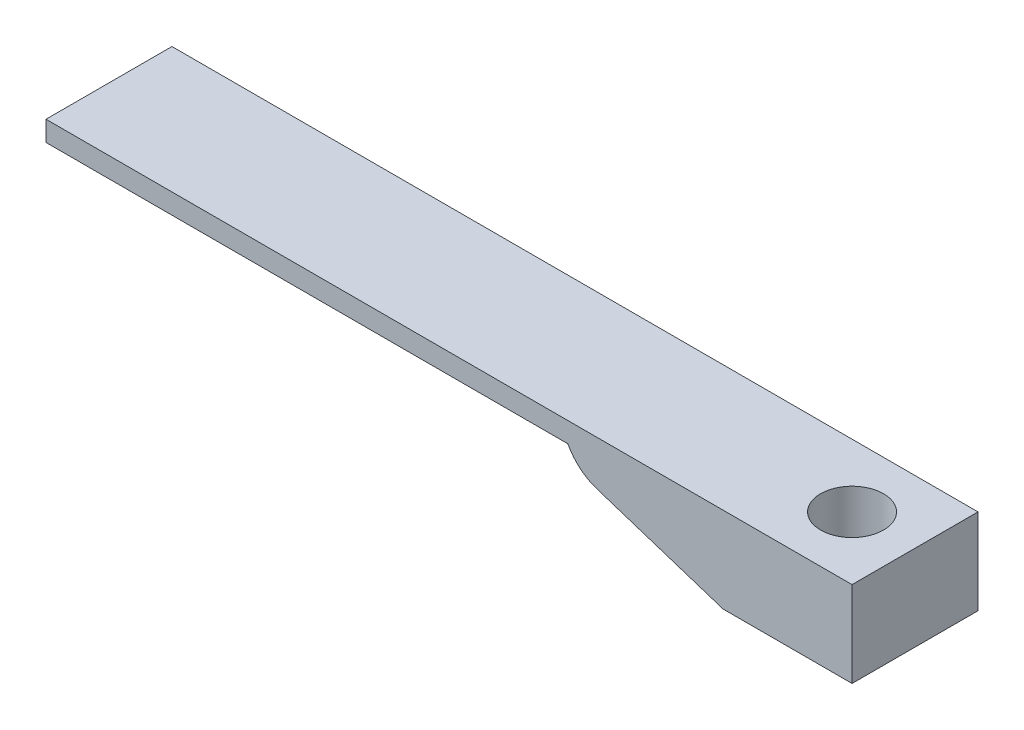
ISO-10303-21;
HEADER;
FILE_DESCRIPTION(('STEP AP214'),'2;1');
FILE_NAME('part.step','',(''),(''),'','','');
FILE_SCHEMA(('AUTOMOTIVE_DESIGN { 1 0 10303 214 1 1 1 1 }'));
ENDSEC;
DATA;
#1=APPLICATION_CONTEXT('core data for automotive mechanical design processes');
#2=APPLICATION_PROTOCOL_DEFINITION('international standard','automotive_design',2000,#1);
#3=PRODUCT_CONTEXT('',#1,'mechanical');
#4=PRODUCT('Part','Part','',(#3));
#5=PRODUCT_RELATED_PRODUCT_CATEGORY('part','',(#4));
#6=PRODUCT_DEFINITION_FORMATION('','',#4);
#7=PRODUCT_DEFINITION_CONTEXT('part definition',#1,'design');
#8=PRODUCT_DEFINITION('design','',#6,#7);
#9=PRODUCT_DEFINITION_SHAPE('','',#8);
#10=(LENGTH_UNIT() NAMED_UNIT(*) SI_UNIT(.MILLI.,.METRE.));
#11=(NAMED_UNIT(*) PLANE_ANGLE_UNIT() SI_UNIT($,.RADIAN.));
#12=(NAMED_UNIT(*) SI_UNIT($,.STERADIAN.) SOLID_ANGLE_UNIT());
#13=UNCERTAINTY_MEASURE_WITH_UNIT(LENGTH_MEASURE(1.E-05),#10,'distance_accuracy_value','');
#14=(GEOMETRIC_REPRESENTATION_CONTEXT(3) GLOBAL_UNCERTAINTY_ASSIGNED_CONTEXT((#13)) GLOBAL_UNIT_ASSIGNED_CONTEXT((#10,
#11,#12)) REPRESENTATION_CONTEXT('',''));
#15=CARTESIAN_POINT('',(0.,0.,0.));
#16=DIRECTION('',(0.,0.,1.));
#17=DIRECTION('',(1.,0.,0.));
#18=AXIS2_PLACEMENT_3D('',#15,#16,#17);
#19=CARTESIAN_POINT('',(0.,0.,0.));
#20=DIRECTION('',(0.,1.,0.));
#21=DIRECTION('',(0.,0.,1.));
#22=AXIS2_PLACEMENT_3D('',#19,#20,#21);
#23=PLANE('',#22);
#24=DIRECTION('',(0.,0.,-1.));
#25=VECTOR('',#24,1.);
#26=CARTESIAN_POINT('',(23.59,0.,0.));
#27=LINE('',#26,#25);
#28=CARTESIAN_POINT('',(23.59,0.,12.5));
#29=VERTEX_POINT('',#28);
#30=CARTESIAN_POINT('',(23.59,0.,-12.5));
#31=VERTEX_POINT('',#30);
#32=EDGE_CURVE('E133',#29,#31,#27,.T.);
#33=ORIENTED_EDGE('',*,*,#32,.F.);
#34=DIRECTION('',(1.,0.,0.));
#35=VECTOR('',#34,1.);
#36=CARTESIAN_POINT('',(0.,0.,12.5));
#37=LINE('',#36,#35);
#38=CARTESIAN_POINT('',(-80.,0.,12.5));
#39=VERTEX_POINT('',#38);
#40=EDGE_CURVE('E141',#39,#29,#37,.T.);
#41=ORIENTED_EDGE('',*,*,#40,.F.);
#42=DIRECTION('',(0.,0.,1.));
#43=VECTOR('',#42,1.);
#44=CARTESIAN_POINT('',(-80.,0.,0.));
#45=LINE('',#44,#43);
#46=CARTESIAN_POINT('',(-80.,0.,-12.5));
#47=VERTEX_POINT('',#46);
#48=EDGE_CURVE('E129',#47,#39,#45,.T.);
#49=ORIENTED_EDGE('',*,*,#48,.F.);
#50=DIRECTION('',(1.,0.,0.));
#51=VECTOR('',#50,1.);
#52=CARTESIAN_POINT('',(0.,0.,-12.5));
#53=LINE('',#52,#51);
#54=EDGE_CURVE('E126',#47,#31,#53,.T.);
#55=ORIENTED_EDGE('',*,*,#54,.T.);
#56=EDGE_LOOP('',(#33,#41,#49,#55));
#57=FACE_BOUND('',#56,.T.);
#58=ADVANCED_FACE('F43',(#57),#23,.F.);
#59=CARTESIAN_POINT('',(80.,4.,0.));
#60=DIRECTION('',(1.,0.,0.));
#61=DIRECTION('',(0.,0.,-1.));
#62=AXIS2_PLACEMENT_3D('',#59,#60,#61);
#63=PLANE('',#62);
#64=DIRECTION('',(0.,-1.,0.));
#65=VECTOR('',#64,1.);
#66=CARTESIAN_POINT('',(80.,4.,12.5));
#67=LINE('',#66,#65);
#68=CARTESIAN_POINT('',(80.,4.,12.5));
#69=VERTEX_POINT('',#68);
#70=CARTESIAN_POINT('',(80.,-13.,12.5));
#71=VERTEX_POINT('',#70);
#72=EDGE_CURVE('E125',#69,#71,#67,.T.);
#73=ORIENTED_EDGE('',*,*,#72,.T.);
#74=DIRECTION('',(0.,0.,1.));
#75=VECTOR('',#74,1.);
#76=CARTESIAN_POINT('',(80.,-13.,0.));
#77=LINE('',#76,#75);
#78=CARTESIAN_POINT('',(80.,-13.,-12.5));
#79=VERTEX_POINT('',#78);
#80=EDGE_CURVE('E106',#79,#71,#77,.T.);
#81=ORIENTED_EDGE('',*,*,#80,.F.);
#82=DIRECTION('',(0.,-1.,0.));
#83=VECTOR('',#82,1.);
#84=CARTESIAN_POINT('',(80.,4.,-12.5));
#85=LINE('',#84,#83);
#86=CARTESIAN_POINT('',(80.,4.,-12.5));
#87=VERTEX_POINT('',#86);
#88=EDGE_CURVE('E114',#87,#79,#85,.T.);
#89=ORIENTED_EDGE('',*,*,#88,.F.);
#90=DIRECTION('',(0.,0.,1.));
#91=VECTOR('',#90,1.);
#92=CARTESIAN_POINT('',(80.,4.,0.));
#93=LINE('',#92,#91);
#94=EDGE_CURVE('E140',#87,#69,#93,.T.);
#95=ORIENTED_EDGE('',*,*,#94,.T.);
#96=EDGE_LOOP('',(#73,#81,#89,#95));
#97=FACE_BOUND('',#96,.T.);
#98=ADVANCED_FACE('F123',(#97),#63,.T.);
#99=CARTESIAN_POINT('',(0.,4.,-12.5));
#100=DIRECTION('',(0.,0.,-1.));
#101=DIRECTION('',(-1.,0.,0.));
#102=AXIS2_PLACEMENT_3D('',#99,#100,#101);
#103=PLANE('',#102);
#104=DIRECTION('',(-0.951056516295154,0.309016994374948,0.));
#105=VECTOR('',#104,1.);
#106=CARTESIAN_POINT('',(0.195396168323853,4.60136757047745,-12.5));
#107=LINE('',#106,#105);
#108=CARTESIAN_POINT('',(54.3668353717526,-13.,-12.5));
#109=VERTEX_POINT('',#108);
#110=CARTESIAN_POINT('',(29.360472256992,-4.87494009286222,-12.5));
#111=VERTEX_POINT('',#110);
#112=EDGE_CURVE('E158',#109,#111,#107,.T.);
#113=ORIENTED_EDGE('',*,*,#112,.T.);
#114=CARTESIAN_POINT('',(32.4506422007414,4.63562507008932,-12.5));
#115=DIRECTION('',(0.,0.,-1.));
#116=DIRECTION('',(-1.,0.,0.));
#117=AXIS2_PLACEMENT_3D('',#114,#115,#116);
#118=CIRCLE('',#117,10.);
#119=EDGE_CURVE('E11',#111,#31,#118,.T.);
#120=ORIENTED_EDGE('',*,*,#119,.T.);
#121=ORIENTED_EDGE('',*,*,#54,.F.);
#122=DIRECTION('',(0.,-1.,0.));
#123=VECTOR('',#122,1.);
#124=CARTESIAN_POINT('',(-80.,4.,-12.5));
#125=LINE('',#124,#123);
#126=CARTESIAN_POINT('',(-80.,4.,-12.5));
#127=VERTEX_POINT('',#126);
#128=EDGE_CURVE('E121',#127,#47,#125,.T.);
#129=ORIENTED_EDGE('',*,*,#128,.F.);
#130=DIRECTION('',(1.,0.,0.));
#131=VECTOR('',#130,1.);
#132=CARTESIAN_POINT('',(0.,4.,-12.5));
#133=LINE('',#132,#131);
#134=EDGE_CURVE('E117',#127,#87,#133,.T.);
#135=ORIENTED_EDGE('',*,*,#134,.T.);
#136=ORIENTED_EDGE('',*,*,#88,.T.);
#137=DIRECTION('',(1.,0.,0.));
#138=VECTOR('',#137,1.);
#139=CARTESIAN_POINT('',(0.,-13.,-12.5));
#140=LINE('',#139,#138);
#141=EDGE_CURVE('E101',#109,#79,#140,.T.);
#142=ORIENTED_EDGE('',*,*,#141,.F.);
#143=EDGE_LOOP('',(#113,#120,#121,#129,#135,#136,#142));
#144=FACE_BOUND('',#143,.T.);
#145=ADVANCED_FACE('F115',(#144),#103,.T.);
#146=CARTESIAN_POINT('',(-80.,4.,0.));
#147=DIRECTION('',(1.,0.,0.));
#148=DIRECTION('',(0.,0.,-1.));
#149=AXIS2_PLACEMENT_3D('',#146,#147,#148);
#150=PLANE('',#149);
#151=ORIENTED_EDGE('',*,*,#48,.T.);
#152=DIRECTION('',(0.,-1.,0.));
#153=VECTOR('',#152,1.);
#154=CARTESIAN_POINT('',(-80.,4.,12.5));
#155=LINE('',#154,#153);
#156=CARTESIAN_POINT('',(-80.,4.,12.5));
#157=VERTEX_POINT('',#156);
#158=EDGE_CURVE('E153',#157,#39,#155,.T.);
#159=ORIENTED_EDGE('',*,*,#158,.F.);
#160=DIRECTION('',(0.,0.,1.));
#161=VECTOR('',#160,1.);
#162=CARTESIAN_POINT('',(-80.,4.,0.));
#163=LINE('',#162,#161);
#164=EDGE_CURVE('E144',#127,#157,#163,.T.);
#165=ORIENTED_EDGE('',*,*,#164,.F.);
#166=ORIENTED_EDGE('',*,*,#128,.T.);
#167=EDGE_LOOP('',(#151,#159,#165,#166));
#168=FACE_BOUND('',#167,.T.);
#169=ADVANCED_FACE('F173',(#168),#150,.F.);
#170=CARTESIAN_POINT('',(67.5,4.,0.));
#171=DIRECTION('',(0.,-1.,0.));
#172=DIRECTION('',(0.,0.,-1.));
#173=AXIS2_PLACEMENT_3D('',#170,#171,#172);
#174=CYLINDRICAL_SURFACE('',#173,6.25);
#175=CARTESIAN_POINT('',(67.5,4.,0.));
#176=DIRECTION('',(0.,1.,0.));
#177=DIRECTION('',(0.,0.,1.));
#178=AXIS2_PLACEMENT_3D('',#175,#176,#177);
#179=CIRCLE('',#178,6.25);
#180=CARTESIAN_POINT('',(67.5,4.,6.25));
#181=VERTEX_POINT('',#180);
#182=EDGE_CURVE('E137',#181,#181,#179,.T.);
#183=ORIENTED_EDGE('',*,*,#182,.T.);
#184=EDGE_LOOP('',(#183));
#185=FACE_BOUND('',#184,.T.);
#186=CARTESIAN_POINT('',(67.5,-13.,0.));
#187=DIRECTION('',(0.,-1.,0.));
#188=DIRECTION('',(0.,0.,-1.));
#189=AXIS2_PLACEMENT_3D('',#186,#187,#188);
#190=CIRCLE('',#189,6.25);
#191=CARTESIAN_POINT('',(67.5,-13.,-6.25));
#192=VERTEX_POINT('',#191);
#193=EDGE_CURVE('E136',#192,#192,#190,.F.);
#194=ORIENTED_EDGE('',*,*,#193,.F.);
#195=EDGE_LOOP('',(#194));
#196=FACE_BOUND('',#195,.T.);
#197=ADVANCED_FACE('F187',(#185,#196),#174,.F.);
#198=CARTESIAN_POINT('',(0.,4.,12.5));
#199=DIRECTION('',(0.,0.,-1.));
#200=DIRECTION('',(-1.,0.,0.));
#201=AXIS2_PLACEMENT_3D('',#198,#199,#200);
#202=PLANE('',#201);
#203=ORIENTED_EDGE('',*,*,#40,.T.);
#204=CARTESIAN_POINT('',(32.4506422007414,4.63562507008932,12.5));
#205=DIRECTION('',(0.,0.,-1.));
#206=DIRECTION('',(-1.,0.,0.));
#207=AXIS2_PLACEMENT_3D('',#204,#205,#206);
#208=CIRCLE('',#207,10.);
#209=CARTESIAN_POINT('',(29.360472256992,-4.87494009286221,12.5));
#210=VERTEX_POINT('',#209);
#211=EDGE_CURVE('E65',#29,#210,#208,.F.);
#212=ORIENTED_EDGE('',*,*,#211,.T.);
#213=DIRECTION('',(0.951056516295154,-0.309016994374948,0.));
#214=VECTOR('',#213,1.);
#215=CARTESIAN_POINT('',(54.3668353717526,-13.,12.5));
#216=LINE('',#215,#214);
#217=CARTESIAN_POINT('',(54.3668353717526,-13.,12.5));
#218=VERTEX_POINT('',#217);
#219=EDGE_CURVE('E160',#210,#218,#216,.T.);
#220=ORIENTED_EDGE('',*,*,#219,.T.);
#221=DIRECTION('',(-1.,0.,0.));
#222=VECTOR('',#221,1.);
#223=CARTESIAN_POINT('',(0.,-13.,12.5));
#224=LINE('',#223,#222);
#225=EDGE_CURVE('E111',#71,#218,#224,.T.);
#226=ORIENTED_EDGE('',*,*,#225,.F.);
#227=ORIENTED_EDGE('',*,*,#72,.F.);
#228=DIRECTION('',(1.,0.,0.));
#229=VECTOR('',#228,1.);
#230=CARTESIAN_POINT('',(0.,4.,12.5));
#231=LINE('',#230,#229);
#232=EDGE_CURVE('E147',#157,#69,#231,.T.);
#233=ORIENTED_EDGE('',*,*,#232,.F.);
#234=ORIENTED_EDGE('',*,*,#158,.T.);
#235=EDGE_LOOP('',(#203,#212,#220,#226,#227,#233,#234));
#236=FACE_BOUND('',#235,.T.);
#237=ADVANCED_FACE('F162',(#236),#202,.F.);
#238=CARTESIAN_POINT('',(0.,4.,0.));
#239=DIRECTION('',(0.,1.,0.));
#240=DIRECTION('',(0.,0.,1.));
#241=AXIS2_PLACEMENT_3D('',#238,#239,#240);
#242=PLANE('',#241);
#243=ORIENTED_EDGE('',*,*,#182,.F.);
#244=EDGE_LOOP('',(#243));
#245=FACE_BOUND('',#244,.T.);
#246=ORIENTED_EDGE('',*,*,#94,.F.);
#247=ORIENTED_EDGE('',*,*,#134,.F.);
#248=ORIENTED_EDGE('',*,*,#164,.T.);
#249=ORIENTED_EDGE('',*,*,#232,.T.);
#250=EDGE_LOOP('',(#246,#247,#248,#249));
#251=FACE_BOUND('',#250,.T.);
#252=ADVANCED_FACE('F175',(#245,#251),#242,.T.);
#253=CARTESIAN_POINT('',(0.,-13.,0.));
#254=DIRECTION('',(0.,-1.,0.));
#255=DIRECTION('',(0.,0.,-1.));
#256=AXIS2_PLACEMENT_3D('',#253,#254,#255);
#257=PLANE('',#256);
#258=ORIENTED_EDGE('',*,*,#193,.T.);
#259=EDGE_LOOP('',(#258));
#260=FACE_BOUND('',#259,.T.);
#261=ORIENTED_EDGE('',*,*,#225,.T.);
#262=DIRECTION('',(0.,0.,-1.));
#263=VECTOR('',#262,1.);
#264=CARTESIAN_POINT('',(54.3668353717526,-13.,-12.5));
#265=LINE('',#264,#263);
#266=EDGE_CURVE('E109',#218,#109,#265,.T.);
#267=ORIENTED_EDGE('',*,*,#266,.T.);
#268=ORIENTED_EDGE('',*,*,#141,.T.);
#269=ORIENTED_EDGE('',*,*,#80,.T.);
#270=EDGE_LOOP('',(#261,#267,#268,#269));
#271=FACE_BOUND('',#270,.T.);
#272=ADVANCED_FACE('F104',(#260,#271),#257,.T.);
#273=CARTESIAN_POINT('',(54.3668353717526,-13.,0.));
#274=DIRECTION('',(-0.309016994374948,-0.951056516295153,0.));
#275=DIRECTION('',(0.,0.,1.));
#276=AXIS2_PLACEMENT_3D('',#273,#274,#275);
#277=PLANE('',#276);
#278=ORIENTED_EDGE('',*,*,#219,.F.);
#279=DIRECTION('',(0.,0.,-1.));
#280=VECTOR('',#279,1.);
#281=CARTESIAN_POINT('',(29.360472256992,-4.87494009286221,-12.5));
#282=LINE('',#281,#280);
#283=EDGE_CURVE('E51',#210,#111,#282,.T.);
#284=ORIENTED_EDGE('',*,*,#283,.T.);
#285=ORIENTED_EDGE('',*,*,#112,.F.);
#286=ORIENTED_EDGE('',*,*,#266,.F.);
#287=EDGE_LOOP('',(#278,#284,#285,#286));
#288=FACE_BOUND('',#287,.T.);
#289=ADVANCED_FACE('F163',(#288),#277,.T.);
#290=CARTESIAN_POINT('',(32.4506422007414,4.63562507008932,0.));
#291=DIRECTION('',(0.,0.,1.));
#292=DIRECTION('',(1.,0.,0.));
#293=AXIS2_PLACEMENT_3D('',#290,#291,#292);
#294=CYLINDRICAL_SURFACE('',#293,10.);
#295=ORIENTED_EDGE('',*,*,#119,.F.);
#296=ORIENTED_EDGE('',*,*,#283,.F.);
#297=ORIENTED_EDGE('',*,*,#211,.F.);
#298=ORIENTED_EDGE('',*,*,#32,.T.);
#299=EDGE_LOOP('',(#295,#296,#297,#298));
#300=FACE_BOUND('',#299,.T.);
#301=ADVANCED_FACE('F45',(#300),#294,.T.);
#302=CLOSED_SHELL('',(#58,#98,#145,#169,#197,#237,#252,#272,#289,#301));
#303=MANIFOLD_SOLID_BREP('B2',#302);
#304=ADVANCED_BREP_SHAPE_REPRESENTATION('',(#18,#303),#14);
#305=SHAPE_DEFINITION_REPRESENTATION(#9,#304);
ENDSEC;
END-ISO-10303-21;
